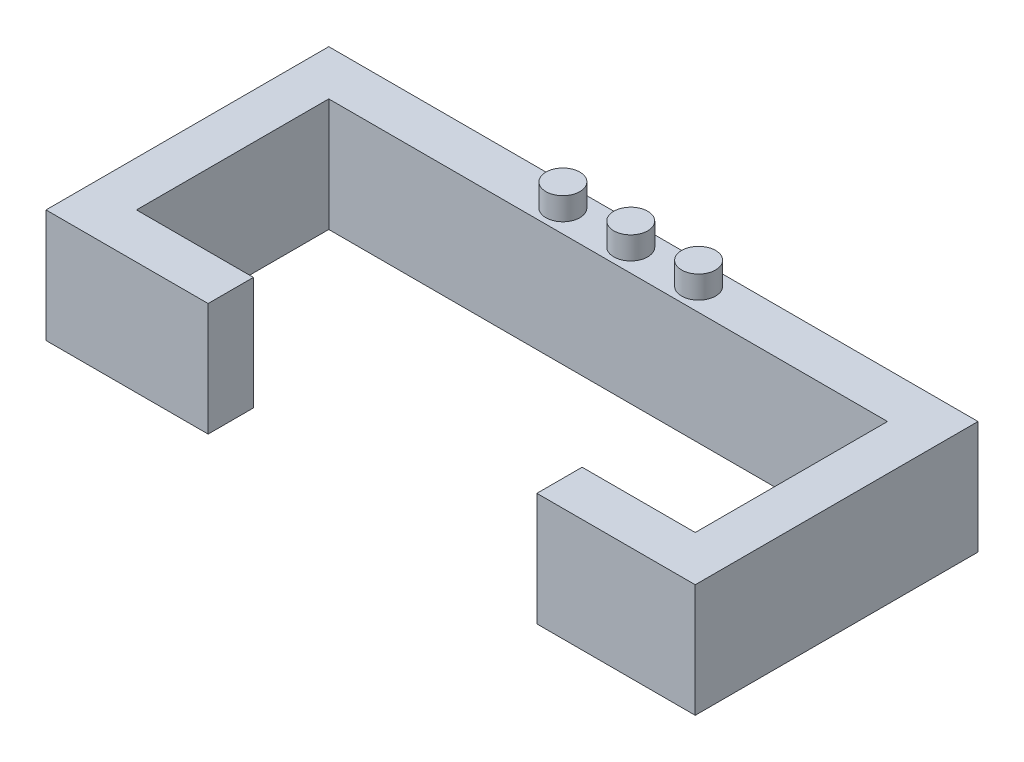
ISO-10303-21;
HEADER;
FILE_DESCRIPTION(('STEP AP214'),'2;1');
FILE_NAME('part.step','',(''),(''),'','','');
FILE_SCHEMA(('AUTOMOTIVE_DESIGN { 1 0 10303 214 1 1 1 1 }'));
ENDSEC;
DATA;
#1=APPLICATION_CONTEXT('core data for automotive mechanical design processes');
#2=APPLICATION_PROTOCOL_DEFINITION('international standard','automotive_design',2000,#1);
#3=PRODUCT_CONTEXT('',#1,'mechanical');
#4=PRODUCT('Part','Part','',(#3));
#5=PRODUCT_RELATED_PRODUCT_CATEGORY('part','',(#4));
#6=PRODUCT_DEFINITION_FORMATION('','',#4);
#7=PRODUCT_DEFINITION_CONTEXT('part definition',#1,'design');
#8=PRODUCT_DEFINITION('design','',#6,#7);
#9=PRODUCT_DEFINITION_SHAPE('','',#8);
#10=(LENGTH_UNIT() NAMED_UNIT(*) SI_UNIT(.MILLI.,.METRE.));
#11=(NAMED_UNIT(*) PLANE_ANGLE_UNIT() SI_UNIT($,.RADIAN.));
#12=(NAMED_UNIT(*) SI_UNIT($,.STERADIAN.) SOLID_ANGLE_UNIT());
#13=UNCERTAINTY_MEASURE_WITH_UNIT(LENGTH_MEASURE(1.E-05),#10,'distance_accuracy_value','');
#14=(GEOMETRIC_REPRESENTATION_CONTEXT(3) GLOBAL_UNCERTAINTY_ASSIGNED_CONTEXT((#13)) GLOBAL_UNIT_ASSIGNED_CONTEXT((#10,
#11,#12)) REPRESENTATION_CONTEXT('',''));
#15=CARTESIAN_POINT('',(0.,0.,0.));
#16=DIRECTION('',(0.,0.,1.));
#17=DIRECTION('',(1.,0.,0.));
#18=AXIS2_PLACEMENT_3D('',#15,#16,#17);
#19=CARTESIAN_POINT('',(7.35,5.,0.));
#20=DIRECTION('',(-1.,0.,0.));
#21=DIRECTION('',(0.,0.,1.));
#22=AXIS2_PLACEMENT_3D('',#19,#20,#21);
#23=PLANE('',#22);
#24=DIRECTION('',(0.,0.,-1.));
#25=VECTOR('',#24,1.);
#26=CARTESIAN_POINT('',(7.35,0.,0.));
#27=LINE('',#26,#25);
#28=CARTESIAN_POINT('',(7.35,0.,3.5));
#29=VERTEX_POINT('',#28);
#30=CARTESIAN_POINT('',(7.35,0.,1.5));
#31=VERTEX_POINT('',#30);
#32=EDGE_CURVE('E159',#29,#31,#27,.T.);
#33=ORIENTED_EDGE('',*,*,#32,.F.);
#34=DIRECTION('',(0.,-1.,0.));
#35=VECTOR('',#34,1.);
#36=CARTESIAN_POINT('',(7.35,5.,3.5));
#37=LINE('',#36,#35);
#38=CARTESIAN_POINT('',(7.35,5.,3.5));
#39=VERTEX_POINT('',#38);
#40=EDGE_CURVE('E11',#39,#29,#37,.T.);
#41=ORIENTED_EDGE('',*,*,#40,.F.);
#42=DIRECTION('',(0.,0.,-1.));
#43=VECTOR('',#42,1.);
#44=CARTESIAN_POINT('',(7.35,5.,0.));
#45=LINE('',#44,#43);
#46=CARTESIAN_POINT('',(7.35,5.,1.5));
#47=VERTEX_POINT('',#46);
#48=EDGE_CURVE('E230',#39,#47,#45,.T.);
#49=ORIENTED_EDGE('',*,*,#48,.T.);
#50=DIRECTION('',(0.,-1.,0.));
#51=VECTOR('',#50,1.);
#52=CARTESIAN_POINT('',(7.35,5.,1.5));
#53=LINE('',#52,#51);
#54=EDGE_CURVE('E57',#47,#31,#53,.T.);
#55=ORIENTED_EDGE('',*,*,#54,.T.);
#56=EDGE_LOOP('',(#33,#41,#49,#55));
#57=FACE_BOUND('',#56,.T.);
#58=ADVANCED_FACE('F41',(#57),#23,.T.);
#59=CARTESIAN_POINT('',(0.,5.,3.5));
#60=DIRECTION('',(0.,0.,1.));
#61=DIRECTION('',(1.,0.,0.));
#62=AXIS2_PLACEMENT_3D('',#59,#60,#61);
#63=PLANE('',#62);
#64=DIRECTION('',(-1.,0.,0.));
#65=VECTOR('',#64,1.);
#66=CARTESIAN_POINT('',(0.,0.,3.5));
#67=LINE('',#66,#65);
#68=CARTESIAN_POINT('',(14.35,0.,3.5));
#69=VERTEX_POINT('',#68);
#70=EDGE_CURVE('E161',#69,#29,#67,.T.);
#71=ORIENTED_EDGE('',*,*,#70,.F.);
#72=DIRECTION('',(0.,-1.,0.));
#73=VECTOR('',#72,1.);
#74=CARTESIAN_POINT('',(14.35,5.,3.5));
#75=LINE('',#74,#73);
#76=CARTESIAN_POINT('',(14.35,5.,3.5));
#77=VERTEX_POINT('',#76);
#78=EDGE_CURVE('E49',#77,#69,#75,.T.);
#79=ORIENTED_EDGE('',*,*,#78,.F.);
#80=DIRECTION('',(-1.,0.,0.));
#81=VECTOR('',#80,1.);
#82=CARTESIAN_POINT('',(0.,5.,3.5));
#83=LINE('',#82,#81);
#84=EDGE_CURVE('E226',#77,#39,#83,.T.);
#85=ORIENTED_EDGE('',*,*,#84,.T.);
#86=ORIENTED_EDGE('',*,*,#40,.T.);
#87=EDGE_LOOP('',(#71,#79,#85,#86));
#88=FACE_BOUND('',#87,.T.);
#89=ADVANCED_FACE('F214',(#88),#63,.T.);
#90=CARTESIAN_POINT('',(14.35,5.,0.));
#91=DIRECTION('',(1.,0.,0.));
#92=DIRECTION('',(0.,0.,-1.));
#93=AXIS2_PLACEMENT_3D('',#90,#91,#92);
#94=PLANE('',#93);
#95=DIRECTION('',(0.,0.,1.));
#96=VECTOR('',#95,1.);
#97=CARTESIAN_POINT('',(14.35,0.,0.));
#98=LINE('',#97,#96);
#99=CARTESIAN_POINT('',(14.35,0.,-9.));
#100=VERTEX_POINT('',#99);
#101=EDGE_CURVE('E165',#100,#69,#98,.T.);
#102=ORIENTED_EDGE('',*,*,#101,.F.);
#103=DIRECTION('',(0.,-1.,0.));
#104=VECTOR('',#103,1.);
#105=CARTESIAN_POINT('',(14.35,5.,-9.));
#106=LINE('',#105,#104);
#107=CARTESIAN_POINT('',(14.35,5.,-9.));
#108=VERTEX_POINT('',#107);
#109=EDGE_CURVE('E203',#108,#100,#106,.T.);
#110=ORIENTED_EDGE('',*,*,#109,.F.);
#111=DIRECTION('',(0.,0.,1.));
#112=VECTOR('',#111,1.);
#113=CARTESIAN_POINT('',(14.35,5.,0.));
#114=LINE('',#113,#112);
#115=EDGE_CURVE('E210',#108,#77,#114,.T.);
#116=ORIENTED_EDGE('',*,*,#115,.T.);
#117=ORIENTED_EDGE('',*,*,#78,.T.);
#118=EDGE_LOOP('',(#102,#110,#116,#117));
#119=FACE_BOUND('',#118,.T.);
#120=ADVANCED_FACE('F208',(#119),#94,.T.);
#121=CARTESIAN_POINT('',(0.,5.,-9.));
#122=DIRECTION('',(0.,0.,-1.));
#123=DIRECTION('',(-1.,0.,0.));
#124=AXIS2_PLACEMENT_3D('',#121,#122,#123);
#125=PLANE('',#124);
#126=DIRECTION('',(1.,0.,0.));
#127=VECTOR('',#126,1.);
#128=CARTESIAN_POINT('',(0.,0.,-9.));
#129=LINE('',#128,#127);
#130=CARTESIAN_POINT('',(-14.35,0.,-9.));
#131=VERTEX_POINT('',#130);
#132=EDGE_CURVE('E168',#131,#100,#129,.T.);
#133=ORIENTED_EDGE('',*,*,#132,.F.);
#134=DIRECTION('',(0.,-1.,0.));
#135=VECTOR('',#134,1.);
#136=CARTESIAN_POINT('',(-14.35,5.,-9.));
#137=LINE('',#136,#135);
#138=CARTESIAN_POINT('',(-14.35,5.,-9.));
#139=VERTEX_POINT('',#138);
#140=EDGE_CURVE('E201',#139,#131,#137,.T.);
#141=ORIENTED_EDGE('',*,*,#140,.F.);
#142=DIRECTION('',(1.,0.,0.));
#143=VECTOR('',#142,1.);
#144=CARTESIAN_POINT('',(0.,5.,-9.));
#145=LINE('',#144,#143);
#146=EDGE_CURVE('E223',#139,#108,#145,.T.);
#147=ORIENTED_EDGE('',*,*,#146,.T.);
#148=ORIENTED_EDGE('',*,*,#109,.T.);
#149=EDGE_LOOP('',(#133,#141,#147,#148));
#150=FACE_BOUND('',#149,.T.);
#151=ADVANCED_FACE('F220',(#150),#125,.T.);
#152=CARTESIAN_POINT('',(-14.35,5.,0.));
#153=DIRECTION('',(-1.,0.,0.));
#154=DIRECTION('',(0.,0.,1.));
#155=AXIS2_PLACEMENT_3D('',#152,#153,#154);
#156=PLANE('',#155);
#157=DIRECTION('',(0.,0.,-1.));
#158=VECTOR('',#157,1.);
#159=CARTESIAN_POINT('',(-14.35,0.,0.));
#160=LINE('',#159,#158);
#161=CARTESIAN_POINT('',(-14.35,0.,3.5));
#162=VERTEX_POINT('',#161);
#163=EDGE_CURVE('E171',#162,#131,#160,.T.);
#164=ORIENTED_EDGE('',*,*,#163,.F.);
#165=DIRECTION('',(0.,-1.,0.));
#166=VECTOR('',#165,1.);
#167=CARTESIAN_POINT('',(-14.35,5.,3.5));
#168=LINE('',#167,#166);
#169=CARTESIAN_POINT('',(-14.35,5.,3.5));
#170=VERTEX_POINT('',#169);
#171=EDGE_CURVE('E199',#170,#162,#168,.T.);
#172=ORIENTED_EDGE('',*,*,#171,.F.);
#173=DIRECTION('',(0.,0.,-1.));
#174=VECTOR('',#173,1.);
#175=CARTESIAN_POINT('',(-14.35,5.,0.));
#176=LINE('',#175,#174);
#177=EDGE_CURVE('E228',#170,#139,#176,.T.);
#178=ORIENTED_EDGE('',*,*,#177,.T.);
#179=ORIENTED_EDGE('',*,*,#140,.T.);
#180=EDGE_LOOP('',(#164,#172,#178,#179));
#181=FACE_BOUND('',#180,.T.);
#182=ADVANCED_FACE('F300',(#181),#156,.T.);
#183=CARTESIAN_POINT('',(0.,5.,3.5));
#184=DIRECTION('',(0.,0.,1.));
#185=DIRECTION('',(1.,0.,0.));
#186=AXIS2_PLACEMENT_3D('',#183,#184,#185);
#187=PLANE('',#186);
#188=DIRECTION('',(-1.,0.,0.));
#189=VECTOR('',#188,1.);
#190=CARTESIAN_POINT('',(0.,0.,3.5));
#191=LINE('',#190,#189);
#192=CARTESIAN_POINT('',(-7.18295512335628,0.,3.5));
#193=VERTEX_POINT('',#192);
#194=EDGE_CURVE('E174',#193,#162,#191,.T.);
#195=ORIENTED_EDGE('',*,*,#194,.F.);
#196=DIRECTION('',(0.,-1.,0.));
#197=VECTOR('',#196,1.);
#198=CARTESIAN_POINT('',(-7.18295512335628,5.,3.5));
#199=LINE('',#198,#197);
#200=CARTESIAN_POINT('',(-7.18295512335628,5.,3.5));
#201=VERTEX_POINT('',#200);
#202=EDGE_CURVE('E197',#201,#193,#199,.T.);
#203=ORIENTED_EDGE('',*,*,#202,.F.);
#204=DIRECTION('',(-1.,0.,0.));
#205=VECTOR('',#204,1.);
#206=CARTESIAN_POINT('',(0.,5.,3.5));
#207=LINE('',#206,#205);
#208=EDGE_CURVE('E235',#201,#170,#207,.T.);
#209=ORIENTED_EDGE('',*,*,#208,.T.);
#210=ORIENTED_EDGE('',*,*,#171,.T.);
#211=EDGE_LOOP('',(#195,#203,#209,#210));
#212=FACE_BOUND('',#211,.T.);
#213=ADVANCED_FACE('F303',(#212),#187,.T.);
#214=CARTESIAN_POINT('',(-7.18295512335628,5.,0.));
#215=DIRECTION('',(1.,0.,0.));
#216=DIRECTION('',(0.,0.,-1.));
#217=AXIS2_PLACEMENT_3D('',#214,#215,#216);
#218=PLANE('',#217);
#219=DIRECTION('',(0.,0.,1.));
#220=VECTOR('',#219,1.);
#221=CARTESIAN_POINT('',(-7.18295512335628,0.,0.));
#222=LINE('',#221,#220);
#223=CARTESIAN_POINT('',(-7.18295512335628,0.,1.5));
#224=VERTEX_POINT('',#223);
#225=EDGE_CURVE('E177',#224,#193,#222,.T.);
#226=ORIENTED_EDGE('',*,*,#225,.F.);
#227=DIRECTION('',(0.,-1.,0.));
#228=VECTOR('',#227,1.);
#229=CARTESIAN_POINT('',(-7.18295512335628,5.,1.5));
#230=LINE('',#229,#228);
#231=CARTESIAN_POINT('',(-7.18295512335628,5.,1.5));
#232=VERTEX_POINT('',#231);
#233=EDGE_CURVE('E195',#232,#224,#230,.T.);
#234=ORIENTED_EDGE('',*,*,#233,.F.);
#235=DIRECTION('',(0.,0.,1.));
#236=VECTOR('',#235,1.);
#237=CARTESIAN_POINT('',(-7.18295512335628,5.,0.));
#238=LINE('',#237,#236);
#239=EDGE_CURVE('E238',#232,#201,#238,.T.);
#240=ORIENTED_EDGE('',*,*,#239,.T.);
#241=ORIENTED_EDGE('',*,*,#202,.T.);
#242=EDGE_LOOP('',(#226,#234,#240,#241));
#243=FACE_BOUND('',#242,.T.);
#244=ADVANCED_FACE('F307',(#243),#218,.T.);
#245=CARTESIAN_POINT('',(0.,5.,1.5));
#246=DIRECTION('',(0.,0.,-1.));
#247=DIRECTION('',(-1.,0.,0.));
#248=AXIS2_PLACEMENT_3D('',#245,#246,#247);
#249=PLANE('',#248);
#250=DIRECTION('',(1.,0.,0.));
#251=VECTOR('',#250,1.);
#252=CARTESIAN_POINT('',(0.,0.,1.5));
#253=LINE('',#252,#251);
#254=CARTESIAN_POINT('',(-12.35,0.,1.5));
#255=VERTEX_POINT('',#254);
#256=EDGE_CURVE('E180',#255,#224,#253,.T.);
#257=ORIENTED_EDGE('',*,*,#256,.F.);
#258=DIRECTION('',(0.,-1.,0.));
#259=VECTOR('',#258,1.);
#260=CARTESIAN_POINT('',(-12.35,5.,1.5));
#261=LINE('',#260,#259);
#262=CARTESIAN_POINT('',(-12.35,5.,1.5));
#263=VERTEX_POINT('',#262);
#264=EDGE_CURVE('E193',#263,#255,#261,.T.);
#265=ORIENTED_EDGE('',*,*,#264,.F.);
#266=DIRECTION('',(1.,0.,0.));
#267=VECTOR('',#266,1.);
#268=CARTESIAN_POINT('',(0.,5.,1.5));
#269=LINE('',#268,#267);
#270=EDGE_CURVE('E156',#263,#232,#269,.T.);
#271=ORIENTED_EDGE('',*,*,#270,.T.);
#272=ORIENTED_EDGE('',*,*,#233,.T.);
#273=EDGE_LOOP('',(#257,#265,#271,#272));
#274=FACE_BOUND('',#273,.T.);
#275=ADVANCED_FACE('F311',(#274),#249,.T.);
#276=CARTESIAN_POINT('',(-12.35,5.,0.));
#277=DIRECTION('',(1.,0.,0.));
#278=DIRECTION('',(0.,0.,-1.));
#279=AXIS2_PLACEMENT_3D('',#276,#277,#278);
#280=PLANE('',#279);
#281=DIRECTION('',(0.,0.,1.));
#282=VECTOR('',#281,1.);
#283=CARTESIAN_POINT('',(-12.35,0.,0.));
#284=LINE('',#283,#282);
#285=CARTESIAN_POINT('',(-12.35,0.,-7.));
#286=VERTEX_POINT('',#285);
#287=EDGE_CURVE('E183',#286,#255,#284,.T.);
#288=ORIENTED_EDGE('',*,*,#287,.F.);
#289=DIRECTION('',(0.,-1.,0.));
#290=VECTOR('',#289,1.);
#291=CARTESIAN_POINT('',(-12.35,5.,-7.));
#292=LINE('',#291,#290);
#293=CARTESIAN_POINT('',(-12.35,5.,-7.));
#294=VERTEX_POINT('',#293);
#295=EDGE_CURVE('E150',#294,#286,#292,.T.);
#296=ORIENTED_EDGE('',*,*,#295,.F.);
#297=DIRECTION('',(0.,0.,1.));
#298=VECTOR('',#297,1.);
#299=CARTESIAN_POINT('',(-12.35,5.,0.));
#300=LINE('',#299,#298);
#301=EDGE_CURVE('E140',#294,#263,#300,.T.);
#302=ORIENTED_EDGE('',*,*,#301,.T.);
#303=ORIENTED_EDGE('',*,*,#264,.T.);
#304=EDGE_LOOP('',(#288,#296,#302,#303));
#305=FACE_BOUND('',#304,.T.);
#306=ADVANCED_FACE('F243',(#305),#280,.T.);
#307=CARTESIAN_POINT('',(0.,5.,-7.));
#308=DIRECTION('',(0.,0.,-1.));
#309=DIRECTION('',(-1.,0.,0.));
#310=AXIS2_PLACEMENT_3D('',#307,#308,#309);
#311=PLANE('',#310);
#312=DIRECTION('',(1.,0.,0.));
#313=VECTOR('',#312,1.);
#314=CARTESIAN_POINT('',(0.,0.,-7.));
#315=LINE('',#314,#313);
#316=CARTESIAN_POINT('',(12.35,0.,-7.));
#317=VERTEX_POINT('',#316);
#318=EDGE_CURVE('E147',#286,#317,#315,.T.);
#319=ORIENTED_EDGE('',*,*,#318,.T.);
#320=DIRECTION('',(0.,-1.,0.));
#321=VECTOR('',#320,1.);
#322=CARTESIAN_POINT('',(12.35,5.,-7.));
#323=LINE('',#322,#321);
#324=CARTESIAN_POINT('',(12.35,5.,-7.));
#325=VERTEX_POINT('',#324);
#326=EDGE_CURVE('E144',#325,#317,#323,.T.);
#327=ORIENTED_EDGE('',*,*,#326,.F.);
#328=DIRECTION('',(1.,0.,0.));
#329=VECTOR('',#328,1.);
#330=CARTESIAN_POINT('',(0.,5.,-7.));
#331=LINE('',#330,#329);
#332=EDGE_CURVE('E132',#294,#325,#331,.T.);
#333=ORIENTED_EDGE('',*,*,#332,.F.);
#334=ORIENTED_EDGE('',*,*,#295,.T.);
#335=EDGE_LOOP('',(#319,#327,#333,#334));
#336=FACE_BOUND('',#335,.T.);
#337=ADVANCED_FACE('F145',(#336),#311,.F.);
#338=CARTESIAN_POINT('',(12.35,5.,0.));
#339=DIRECTION('',(-1.,0.,0.));
#340=DIRECTION('',(0.,0.,1.));
#341=AXIS2_PLACEMENT_3D('',#338,#339,#340);
#342=PLANE('',#341);
#343=DIRECTION('',(0.,0.,-1.));
#344=VECTOR('',#343,1.);
#345=CARTESIAN_POINT('',(12.35,0.,0.));
#346=LINE('',#345,#344);
#347=CARTESIAN_POINT('',(12.35,0.,1.5));
#348=VERTEX_POINT('',#347);
#349=EDGE_CURVE('E188',#348,#317,#346,.T.);
#350=ORIENTED_EDGE('',*,*,#349,.F.);
#351=DIRECTION('',(0.,-1.,0.));
#352=VECTOR('',#351,1.);
#353=CARTESIAN_POINT('',(12.35,5.,1.5));
#354=LINE('',#353,#352);
#355=CARTESIAN_POINT('',(12.35,5.,1.5));
#356=VERTEX_POINT('',#355);
#357=EDGE_CURVE('E94',#356,#348,#354,.T.);
#358=ORIENTED_EDGE('',*,*,#357,.F.);
#359=DIRECTION('',(0.,0.,-1.));
#360=VECTOR('',#359,1.);
#361=CARTESIAN_POINT('',(12.35,5.,0.));
#362=LINE('',#361,#360);
#363=EDGE_CURVE('E137',#356,#325,#362,.T.);
#364=ORIENTED_EDGE('',*,*,#363,.T.);
#365=ORIENTED_EDGE('',*,*,#326,.T.);
#366=EDGE_LOOP('',(#350,#358,#364,#365));
#367=FACE_BOUND('',#366,.T.);
#368=ADVANCED_FACE('F152',(#367),#342,.T.);
#369=EDGE_CURVE('E184',#31,#348,#253,.T.);
#370=ORIENTED_EDGE('',*,*,#369,.F.);
#371=ORIENTED_EDGE('',*,*,#54,.F.);
#372=EDGE_CURVE('E153',#47,#356,#269,.T.);
#373=ORIENTED_EDGE('',*,*,#372,.T.);
#374=ORIENTED_EDGE('',*,*,#357,.T.);
#375=EDGE_LOOP('',(#370,#371,#373,#374));
#376=FACE_BOUND('',#375,.T.);
#377=ADVANCED_FACE('F269',(#376),#249,.T.);
#378=CARTESIAN_POINT('',(0.,5.,0.));
#379=DIRECTION('',(0.,1.,0.));
#380=DIRECTION('',(0.,0.,1.));
#381=AXIS2_PLACEMENT_3D('',#378,#379,#380);
#382=PLANE('',#381);
#383=CARTESIAN_POINT('',(3.,5.,-8.));
#384=DIRECTION('',(0.,1.,0.));
#385=DIRECTION('',(0.,0.,-1.));
#386=AXIS2_PLACEMENT_3D('',#383,#384,#385);
#387=CIRCLE('',#386,0.75);
#388=CARTESIAN_POINT('',(3.,5.,-8.75));
#389=VERTEX_POINT('',#388);
#390=EDGE_CURVE('E256',#389,#389,#387,.T.);
#391=ORIENTED_EDGE('',*,*,#390,.F.);
#392=EDGE_LOOP('',(#391));
#393=FACE_BOUND('',#392,.T.);
#394=CARTESIAN_POINT('',(-3.,5.,-8.));
#395=DIRECTION('',(0.,1.,0.));
#396=DIRECTION('',(0.,0.,1.));
#397=AXIS2_PLACEMENT_3D('',#394,#395,#396);
#398=CIRCLE('',#397,0.75);
#399=CARTESIAN_POINT('',(-3.,5.,-7.25));
#400=VERTEX_POINT('',#399);
#401=EDGE_CURVE('E250',#400,#400,#398,.T.);
#402=ORIENTED_EDGE('',*,*,#401,.F.);
#403=EDGE_LOOP('',(#402));
#404=FACE_BOUND('',#403,.T.);
#405=CARTESIAN_POINT('',(0.,5.,-7.99999999999999));
#406=DIRECTION('',(0.,1.,0.));
#407=DIRECTION('',(0.,0.,1.));
#408=AXIS2_PLACEMENT_3D('',#405,#406,#407);
#409=CIRCLE('',#408,0.750000000000001);
#410=CARTESIAN_POINT('',(0.,5.,-7.24999999999999));
#411=VERTEX_POINT('',#410);
#412=EDGE_CURVE('E247',#411,#411,#409,.T.);
#413=ORIENTED_EDGE('',*,*,#412,.F.);
#414=EDGE_LOOP('',(#413));
#415=FACE_BOUND('',#414,.T.);
#416=ORIENTED_EDGE('',*,*,#48,.F.);
#417=ORIENTED_EDGE('',*,*,#84,.F.);
#418=ORIENTED_EDGE('',*,*,#115,.F.);
#419=ORIENTED_EDGE('',*,*,#146,.F.);
#420=ORIENTED_EDGE('',*,*,#177,.F.);
#421=ORIENTED_EDGE('',*,*,#208,.F.);
#422=ORIENTED_EDGE('',*,*,#239,.F.);
#423=ORIENTED_EDGE('',*,*,#270,.F.);
#424=ORIENTED_EDGE('',*,*,#301,.F.);
#425=ORIENTED_EDGE('',*,*,#332,.T.);
#426=ORIENTED_EDGE('',*,*,#363,.F.);
#427=ORIENTED_EDGE('',*,*,#372,.F.);
#428=EDGE_LOOP('',(#416,#417,#418,#419,#420,#421,#422,#423,#424,#425,#426,#427));
#429=FACE_BOUND('',#428,.T.);
#430=ADVANCED_FACE('F134',(#393,#404,#415,#429),#382,.T.);
#431=CARTESIAN_POINT('',(0.,0.,0.));
#432=DIRECTION('',(0.,1.,0.));
#433=DIRECTION('',(0.,0.,1.));
#434=AXIS2_PLACEMENT_3D('',#431,#432,#433);
#435=PLANE('',#434);
#436=ORIENTED_EDGE('',*,*,#32,.T.);
#437=ORIENTED_EDGE('',*,*,#369,.T.);
#438=ORIENTED_EDGE('',*,*,#349,.T.);
#439=ORIENTED_EDGE('',*,*,#318,.F.);
#440=ORIENTED_EDGE('',*,*,#287,.T.);
#441=ORIENTED_EDGE('',*,*,#256,.T.);
#442=ORIENTED_EDGE('',*,*,#225,.T.);
#443=ORIENTED_EDGE('',*,*,#194,.T.);
#444=ORIENTED_EDGE('',*,*,#163,.T.);
#445=ORIENTED_EDGE('',*,*,#132,.T.);
#446=ORIENTED_EDGE('',*,*,#101,.T.);
#447=ORIENTED_EDGE('',*,*,#70,.T.);
#448=EDGE_LOOP('',(#436,#437,#438,#439,#440,#441,#442,#443,#444,#445,#446,#447));
#449=FACE_BOUND('',#448,.T.);
#450=ADVANCED_FACE('F216',(#449),#435,.F.);
#451=CARTESIAN_POINT('',(0.,6.,-7.99999999999999));
#452=DIRECTION('',(0.,-1.,0.));
#453=DIRECTION('',(0.,0.,-1.));
#454=AXIS2_PLACEMENT_3D('',#451,#452,#453);
#455=CYLINDRICAL_SURFACE('',#454,0.750000000000001);
#456=CARTESIAN_POINT('',(0.,6.,-7.99999999999999));
#457=DIRECTION('',(0.,1.,0.));
#458=DIRECTION('',(0.,0.,1.));
#459=AXIS2_PLACEMENT_3D('',#456,#457,#458);
#460=CIRCLE('',#459,0.750000000000001);
#461=CARTESIAN_POINT('',(0.,6.,-7.24999999999999));
#462=VERTEX_POINT('',#461);
#463=EDGE_CURVE('E162',#462,#462,#460,.T.);
#464=ORIENTED_EDGE('',*,*,#463,.F.);
#465=EDGE_LOOP('',(#464));
#466=FACE_BOUND('',#465,.T.);
#467=ORIENTED_EDGE('',*,*,#412,.T.);
#468=EDGE_LOOP('',(#467));
#469=FACE_BOUND('',#468,.T.);
#470=ADVANCED_FACE('F275',(#466,#469),#455,.T.);
#471=CARTESIAN_POINT('',(0.,6.,-7.99999999999999));
#472=DIRECTION('',(0.,1.,0.));
#473=DIRECTION('',(0.,0.,1.));
#474=AXIS2_PLACEMENT_3D('',#471,#472,#473);
#475=PLANE('',#474);
#476=ORIENTED_EDGE('',*,*,#463,.T.);
#477=EDGE_LOOP('',(#476));
#478=FACE_BOUND('',#477,.T.);
#479=ADVANCED_FACE('F277',(#478),#475,.T.);
#480=CARTESIAN_POINT('',(-3.,6.,-8.));
#481=DIRECTION('',(0.,-1.,0.));
#482=DIRECTION('',(0.,0.,-1.));
#483=AXIS2_PLACEMENT_3D('',#480,#481,#482);
#484=CYLINDRICAL_SURFACE('',#483,0.75);
#485=CARTESIAN_POINT('',(-3.,6.,-8.));
#486=DIRECTION('',(0.,1.,0.));
#487=DIRECTION('',(0.,0.,1.));
#488=AXIS2_PLACEMENT_3D('',#485,#486,#487);
#489=CIRCLE('',#488,0.75);
#490=CARTESIAN_POINT('',(-3.,6.,-7.25));
#491=VERTEX_POINT('',#490);
#492=EDGE_CURVE('E253',#491,#491,#489,.T.);
#493=ORIENTED_EDGE('',*,*,#492,.F.);
#494=EDGE_LOOP('',(#493));
#495=FACE_BOUND('',#494,.T.);
#496=ORIENTED_EDGE('',*,*,#401,.T.);
#497=EDGE_LOOP('',(#496));
#498=FACE_BOUND('',#497,.T.);
#499=ADVANCED_FACE('F283',(#495,#498),#484,.T.);
#500=CARTESIAN_POINT('',(-3.,6.,-8.));
#501=DIRECTION('',(0.,1.,0.));
#502=DIRECTION('',(0.,0.,1.));
#503=AXIS2_PLACEMENT_3D('',#500,#501,#502);
#504=PLANE('',#503);
#505=ORIENTED_EDGE('',*,*,#492,.T.);
#506=EDGE_LOOP('',(#505));
#507=FACE_BOUND('',#506,.T.);
#508=ADVANCED_FACE('F386',(#507),#504,.T.);
#509=CARTESIAN_POINT('',(3.,6.,-8.));
#510=DIRECTION('',(0.,-1.,0.));
#511=DIRECTION('',(0.,0.,-1.));
#512=AXIS2_PLACEMENT_3D('',#509,#510,#511);
#513=CYLINDRICAL_SURFACE('',#512,0.75);
#514=CARTESIAN_POINT('',(3.,6.,-8.));
#515=DIRECTION('',(0.,1.,0.));
#516=DIRECTION('',(0.,0.,-1.));
#517=AXIS2_PLACEMENT_3D('',#514,#515,#516);
#518=CIRCLE('',#517,0.75);
#519=CARTESIAN_POINT('',(3.,6.,-8.75));
#520=VERTEX_POINT('',#519);
#521=EDGE_CURVE('E259',#520,#520,#518,.T.);
#522=ORIENTED_EDGE('',*,*,#521,.F.);
#523=EDGE_LOOP('',(#522));
#524=FACE_BOUND('',#523,.T.);
#525=ORIENTED_EDGE('',*,*,#390,.T.);
#526=EDGE_LOOP('',(#525));
#527=FACE_BOUND('',#526,.T.);
#528=ADVANCED_FACE('F265',(#524,#527),#513,.T.);
#529=CARTESIAN_POINT('',(3.,6.,-8.));
#530=DIRECTION('',(0.,-1.,0.));
#531=DIRECTION('',(0.,0.,-1.));
#532=AXIS2_PLACEMENT_3D('',#529,#530,#531);
#533=PLANE('',#532);
#534=ORIENTED_EDGE('',*,*,#521,.T.);
#535=EDGE_LOOP('',(#534));
#536=FACE_BOUND('',#535,.T.);
#537=ADVANCED_FACE('F405',(#536),#533,.F.);
#538=CLOSED_SHELL('',(#58,#89,#120,#151,#182,#213,#244,#275,#306,#337,#368,#377,#430,#450,#470,
#479,#499,#508,#528,#537));
#539=MANIFOLD_SOLID_BREP('B2',#538);
#540=ADVANCED_BREP_SHAPE_REPRESENTATION('',(#18,#539),#14);
#541=SHAPE_DEFINITION_REPRESENTATION(#9,#540);
ENDSEC;
END-ISO-10303-21;
